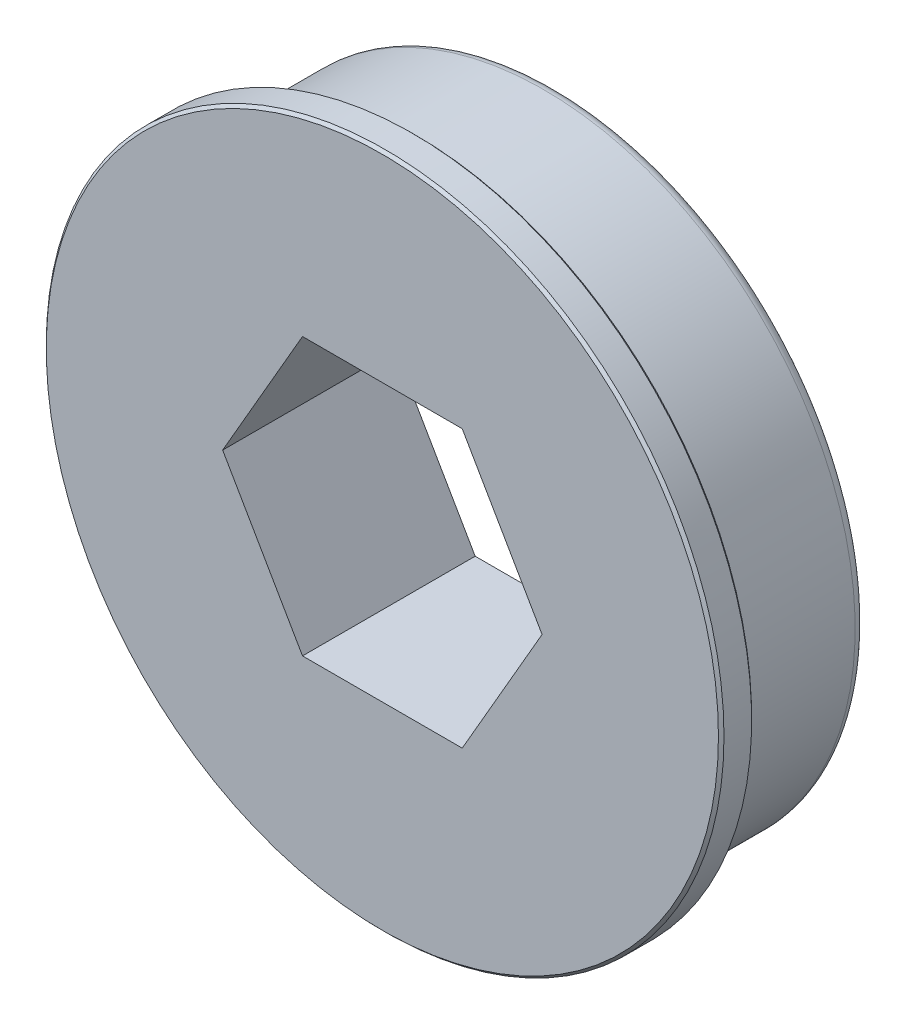
ISO-10303-21;
HEADER;
FILE_DESCRIPTION(('STEP AP214'),'2;1');
FILE_NAME('part.step','',(''),(''),'','','');
FILE_SCHEMA(('AUTOMOTIVE_DESIGN { 1 0 10303 214 1 1 1 1 }'));
ENDSEC;
DATA;
#1=APPLICATION_CONTEXT('core data for automotive mechanical design processes');
#2=APPLICATION_PROTOCOL_DEFINITION('international standard','automotive_design',2000,#1);
#3=PRODUCT_CONTEXT('',#1,'mechanical');
#4=PRODUCT('Part','Part','',(#3));
#5=PRODUCT_RELATED_PRODUCT_CATEGORY('part','',(#4));
#6=PRODUCT_DEFINITION_FORMATION('','',#4);
#7=PRODUCT_DEFINITION_CONTEXT('part definition',#1,'design');
#8=PRODUCT_DEFINITION('design','',#6,#7);
#9=PRODUCT_DEFINITION_SHAPE('','',#8);
#10=(LENGTH_UNIT() NAMED_UNIT(*) SI_UNIT(.MILLI.,.METRE.));
#11=(NAMED_UNIT(*) PLANE_ANGLE_UNIT() SI_UNIT($,.RADIAN.));
#12=(NAMED_UNIT(*) SI_UNIT($,.STERADIAN.) SOLID_ANGLE_UNIT());
#13=UNCERTAINTY_MEASURE_WITH_UNIT(LENGTH_MEASURE(1.E-05),#10,'distance_accuracy_value','');
#14=(GEOMETRIC_REPRESENTATION_CONTEXT(3) GLOBAL_UNCERTAINTY_ASSIGNED_CONTEXT((#13)) GLOBAL_UNIT_ASSIGNED_CONTEXT((#10,
#11,#12)) REPRESENTATION_CONTEXT('',''));
#15=CARTESIAN_POINT('',(0.,0.,0.));
#16=DIRECTION('',(0.,0.,1.));
#17=DIRECTION('',(1.,0.,0.));
#18=AXIS2_PLACEMENT_3D('',#15,#16,#17);
#19=CARTESIAN_POINT('',(0.,0.,7.92734));
#20=DIRECTION('',(0.,0.,-1.));
#21=DIRECTION('',(-1.,0.,0.));
#22=AXIS2_PLACEMENT_3D('',#19,#20,#21);
#23=CYLINDRICAL_SURFACE('',#22,15.5575);
#24=CARTESIAN_POINT('',(0.,0.,6.53034000000032));
#25=DIRECTION('',(0.,0.,-1.));
#26=DIRECTION('',(-1.,0.,0.));
#27=AXIS2_PLACEMENT_3D('',#24,#25,#26);
#28=CIRCLE('',#27,15.5575);
#29=CARTESIAN_POINT('',(-15.5575,0.,6.53034000000032));
#30=VERTEX_POINT('',#29);
#31=EDGE_CURVE('E152',#30,#30,#28,.F.);
#32=ORIENTED_EDGE('',*,*,#31,.T.);
#33=EDGE_LOOP('',(#32));
#34=FACE_BOUND('',#33,.T.);
#35=CARTESIAN_POINT('',(0.,0.,7.80034000000032));
#36=DIRECTION('',(0.,0.,1.));
#37=DIRECTION('',(1.,0.,0.));
#38=AXIS2_PLACEMENT_3D('',#35,#36,#37);
#39=CIRCLE('',#38,15.5575);
#40=CARTESIAN_POINT('',(15.5575,0.,7.80034000000032));
#41=VERTEX_POINT('',#40);
#42=EDGE_CURVE('E149',#41,#41,#39,.F.);
#43=ORIENTED_EDGE('',*,*,#42,.T.);
#44=EDGE_LOOP('',(#43));
#45=FACE_BOUND('',#44,.T.);
#46=ADVANCED_FACE('F33',(#34,#45),#23,.T.);
#47=CARTESIAN_POINT('',(15.5575,0.,7.92734));
#48=DIRECTION('',(0.,0.,1.));
#49=DIRECTION('',(1.,0.,0.));
#50=AXIS2_PLACEMENT_3D('',#47,#48,#49);
#51=PLANE('',#50);
#52=CARTESIAN_POINT('',(0.,0.,7.92734));
#53=DIRECTION('',(0.,0.,1.));
#54=DIRECTION('',(1.,0.,0.));
#55=AXIS2_PLACEMENT_3D('',#52,#53,#54);
#56=CIRCLE('',#55,15.4304999999997);
#57=CARTESIAN_POINT('',(15.4304999999997,0.,7.92734));
#58=VERTEX_POINT('',#57);
#59=EDGE_CURVE('E155',#58,#58,#56,.T.);
#60=ORIENTED_EDGE('',*,*,#59,.T.);
#61=EDGE_LOOP('',(#60));
#62=FACE_BOUND('',#61,.T.);
#63=DIRECTION('',(0.5,0.866025403784439,0.));
#64=VECTOR('',#63,1.);
#65=CARTESIAN_POINT('',(3.66617420935412,-6.35,7.92734));
#66=LINE('',#65,#64);
#67=CARTESIAN_POINT('',(3.66617420935412,-6.35,7.92734));
#68=VERTEX_POINT('',#67);
#69=CARTESIAN_POINT('',(7.33234841870824,0.,7.92734));
#70=VERTEX_POINT('',#69);
#71=EDGE_CURVE('E48',#68,#70,#66,.T.);
#72=ORIENTED_EDGE('',*,*,#71,.F.);
#73=DIRECTION('',(1.,0.,0.));
#74=VECTOR('',#73,1.);
#75=CARTESIAN_POINT('',(-3.66617420935413,-6.35,7.92734));
#76=LINE('',#75,#74);
#77=CARTESIAN_POINT('',(-3.66617420935413,-6.35,7.92734));
#78=VERTEX_POINT('',#77);
#79=EDGE_CURVE('E104',#78,#68,#76,.T.);
#80=ORIENTED_EDGE('',*,*,#79,.F.);
#81=DIRECTION('',(0.5,-0.866025403784439,0.));
#82=VECTOR('',#81,1.);
#83=CARTESIAN_POINT('',(-7.33234841870825,0.,7.92734));
#84=LINE('',#83,#82);
#85=CARTESIAN_POINT('',(-7.33234841870825,0.,7.92734));
#86=VERTEX_POINT('',#85);
#87=EDGE_CURVE('E107',#86,#78,#84,.T.);
#88=ORIENTED_EDGE('',*,*,#87,.F.);
#89=DIRECTION('',(-0.5,-0.866025403784439,0.));
#90=VECTOR('',#89,1.);
#91=CARTESIAN_POINT('',(-3.66617420935413,6.35,7.92734));
#92=LINE('',#91,#90);
#93=CARTESIAN_POINT('',(-3.66617420935413,6.35,7.92734));
#94=VERTEX_POINT('',#93);
#95=EDGE_CURVE('E123',#94,#86,#92,.T.);
#96=ORIENTED_EDGE('',*,*,#95,.F.);
#97=DIRECTION('',(-1.,0.,0.));
#98=VECTOR('',#97,1.);
#99=CARTESIAN_POINT('',(3.66617420935412,6.35,7.92734));
#100=LINE('',#99,#98);
#101=CARTESIAN_POINT('',(3.66617420935412,6.35,7.92734));
#102=VERTEX_POINT('',#101);
#103=EDGE_CURVE('E120',#102,#94,#100,.T.);
#104=ORIENTED_EDGE('',*,*,#103,.F.);
#105=DIRECTION('',(-0.5,0.866025403784438,0.));
#106=VECTOR('',#105,1.);
#107=CARTESIAN_POINT('',(7.33234841870825,0.,7.92734));
#108=LINE('',#107,#106);
#109=EDGE_CURVE('E118',#70,#102,#108,.T.);
#110=ORIENTED_EDGE('',*,*,#109,.F.);
#111=EDGE_LOOP('',(#72,#80,#88,#96,#104,#110));
#112=FACE_BOUND('',#111,.T.);
#113=ADVANCED_FACE('F171',(#62,#112),#51,.T.);
#114=CARTESIAN_POINT('',(0.,0.,0.));
#115=DIRECTION('',(0.,0.,-1.));
#116=DIRECTION('',(-1.,0.,0.));
#117=AXIS2_PLACEMENT_3D('',#114,#115,#116);
#118=PLANE('',#117);
#119=CARTESIAN_POINT('',(0.,0.,0.));
#120=DIRECTION('',(0.,0.,-1.));
#121=DIRECTION('',(-1.,0.,0.));
#122=AXIS2_PLACEMENT_3D('',#119,#120,#121);
#123=CIRCLE('',#122,13.7795);
#124=CARTESIAN_POINT('',(-13.7795,0.,0.));
#125=VERTEX_POINT('',#124);
#126=EDGE_CURVE('E41',#125,#125,#123,.T.);
#127=ORIENTED_EDGE('',*,*,#126,.T.);
#128=EDGE_LOOP('',(#127));
#129=FACE_BOUND('',#128,.T.);
#130=DIRECTION('',(0.5,0.866025403784439,0.));
#131=VECTOR('',#130,1.);
#132=CARTESIAN_POINT('',(3.66617420935412,-6.35,0.));
#133=LINE('',#132,#131);
#134=CARTESIAN_POINT('',(3.66617420935412,-6.35,0.));
#135=VERTEX_POINT('',#134);
#136=CARTESIAN_POINT('',(7.33234841870825,0.,0.));
#137=VERTEX_POINT('',#136);
#138=EDGE_CURVE('E88',#135,#137,#133,.T.);
#139=ORIENTED_EDGE('',*,*,#138,.T.);
#140=DIRECTION('',(-0.5,0.866025403784438,0.));
#141=VECTOR('',#140,1.);
#142=CARTESIAN_POINT('',(7.33234841870825,0.,0.));
#143=LINE('',#142,#141);
#144=CARTESIAN_POINT('',(3.66617420935412,6.35,0.));
#145=VERTEX_POINT('',#144);
#146=EDGE_CURVE('E97',#137,#145,#143,.T.);
#147=ORIENTED_EDGE('',*,*,#146,.T.);
#148=DIRECTION('',(-1.,0.,0.));
#149=VECTOR('',#148,1.);
#150=CARTESIAN_POINT('',(3.66617420935412,6.35,0.));
#151=LINE('',#150,#149);
#152=CARTESIAN_POINT('',(-3.66617420935413,6.35,0.));
#153=VERTEX_POINT('',#152);
#154=EDGE_CURVE('E56',#145,#153,#151,.T.);
#155=ORIENTED_EDGE('',*,*,#154,.T.);
#156=DIRECTION('',(-0.5,-0.866025403784439,0.));
#157=VECTOR('',#156,1.);
#158=CARTESIAN_POINT('',(-3.66617420935413,6.35,0.));
#159=LINE('',#158,#157);
#160=CARTESIAN_POINT('',(-7.33234841870825,0.,0.));
#161=VERTEX_POINT('',#160);
#162=EDGE_CURVE('E111',#153,#161,#159,.T.);
#163=ORIENTED_EDGE('',*,*,#162,.T.);
#164=DIRECTION('',(0.5,-0.866025403784439,0.));
#165=VECTOR('',#164,1.);
#166=CARTESIAN_POINT('',(-7.33234841870825,0.,0.));
#167=LINE('',#166,#165);
#168=CARTESIAN_POINT('',(-3.66617420935413,-6.35,0.));
#169=VERTEX_POINT('',#168);
#170=EDGE_CURVE('E114',#161,#169,#167,.T.);
#171=ORIENTED_EDGE('',*,*,#170,.T.);
#172=DIRECTION('',(1.,0.,0.));
#173=VECTOR('',#172,1.);
#174=CARTESIAN_POINT('',(-3.66617420935413,-6.35,0.));
#175=LINE('',#174,#173);
#176=EDGE_CURVE('E94',#169,#135,#175,.T.);
#177=ORIENTED_EDGE('',*,*,#176,.T.);
#178=EDGE_LOOP('',(#139,#147,#155,#163,#171,#177));
#179=FACE_BOUND('',#178,.T.);
#180=ADVANCED_FACE('F101',(#129,#179),#118,.T.);
#181=CARTESIAN_POINT('',(0.,0.,7.92734));
#182=DIRECTION('',(0.,0.,-1.));
#183=DIRECTION('',(-1.,0.,0.));
#184=AXIS2_PLACEMENT_3D('',#181,#182,#183);
#185=CYLINDRICAL_SURFACE('',#184,14.2875);
#186=CARTESIAN_POINT('',(0.,0.,0.508000000000003));
#187=DIRECTION('',(0.,0.,-1.));
#188=DIRECTION('',(-1.,0.,0.));
#189=AXIS2_PLACEMENT_3D('',#186,#187,#188);
#190=CIRCLE('',#189,14.2875);
#191=CARTESIAN_POINT('',(-14.2875,0.,0.508000000000003));
#192=VERTEX_POINT('',#191);
#193=EDGE_CURVE('E11',#192,#192,#190,.F.);
#194=ORIENTED_EDGE('',*,*,#193,.T.);
#195=EDGE_LOOP('',(#194));
#196=FACE_BOUND('',#195,.T.);
#197=CARTESIAN_POINT('',(0.,0.,5.89534));
#198=DIRECTION('',(0.,0.,-1.));
#199=DIRECTION('',(-1.,0.,0.));
#200=AXIS2_PLACEMENT_3D('',#197,#198,#199);
#201=CIRCLE('',#200,14.2875);
#202=CARTESIAN_POINT('',(-14.2875,0.,5.89534));
#203=VERTEX_POINT('',#202);
#204=EDGE_CURVE('E143',#203,#203,#201,.T.);
#205=ORIENTED_EDGE('',*,*,#204,.T.);
#206=EDGE_LOOP('',(#205));
#207=FACE_BOUND('',#206,.T.);
#208=ADVANCED_FACE('F208',(#196,#207),#185,.T.);
#209=CARTESIAN_POINT('',(14.2875,0.,5.89534));
#210=DIRECTION('',(0.,0.,1.));
#211=DIRECTION('',(1.,0.,0.));
#212=AXIS2_PLACEMENT_3D('',#209,#210,#211);
#213=PLANE('',#212);
#214=CARTESIAN_POINT('',(0.,0.,5.89534));
#215=DIRECTION('',(0.,0.,-1.));
#216=DIRECTION('',(-1.,0.,0.));
#217=AXIS2_PLACEMENT_3D('',#214,#215,#216);
#218=CIRCLE('',#217,13.97);
#219=CARTESIAN_POINT('',(-13.97,0.,5.89534));
#220=VERTEX_POINT('',#219);
#221=EDGE_CURVE('E140',#220,#220,#218,.T.);
#222=ORIENTED_EDGE('',*,*,#221,.T.);
#223=EDGE_LOOP('',(#222));
#224=FACE_BOUND('',#223,.T.);
#225=ORIENTED_EDGE('',*,*,#204,.F.);
#226=EDGE_LOOP('',(#225));
#227=FACE_BOUND('',#226,.T.);
#228=ADVANCED_FACE('F202',(#224,#227),#213,.T.);
#229=CARTESIAN_POINT('',(0.,0.,7.92734));
#230=DIRECTION('',(0.,0.,-1.));
#231=DIRECTION('',(-1.,0.,0.));
#232=AXIS2_PLACEMENT_3D('',#229,#230,#231);
#233=CYLINDRICAL_SURFACE('',#232,13.97);
#234=CARTESIAN_POINT('',(0.,0.,6.40333999999999));
#235=DIRECTION('',(0.,0.,-1.));
#236=DIRECTION('',(-1.,0.,0.));
#237=AXIS2_PLACEMENT_3D('',#234,#235,#236);
#238=CIRCLE('',#237,13.97);
#239=CARTESIAN_POINT('',(-13.97,0.,6.40333999999999));
#240=VERTEX_POINT('',#239);
#241=EDGE_CURVE('E130',#240,#240,#238,.T.);
#242=ORIENTED_EDGE('',*,*,#241,.T.);
#243=EDGE_LOOP('',(#242));
#244=FACE_BOUND('',#243,.T.);
#245=ORIENTED_EDGE('',*,*,#221,.F.);
#246=EDGE_LOOP('',(#245));
#247=FACE_BOUND('',#246,.T.);
#248=ADVANCED_FACE('F196',(#244,#247),#233,.T.);
#249=CARTESIAN_POINT('',(13.97,0.,6.40334));
#250=DIRECTION('',(0.,0.,-1.));
#251=DIRECTION('',(-1.,0.,0.));
#252=AXIS2_PLACEMENT_3D('',#249,#250,#251);
#253=PLANE('',#252);
#254=CARTESIAN_POINT('',(0.,0.,6.40334));
#255=DIRECTION('',(0.,0.,-1.));
#256=DIRECTION('',(-1.,0.,0.));
#257=AXIS2_PLACEMENT_3D('',#254,#255,#256);
#258=CIRCLE('',#257,15.4305000000003);
#259=CARTESIAN_POINT('',(-15.4305000000003,0.,6.40334));
#260=VERTEX_POINT('',#259);
#261=EDGE_CURVE('E146',#260,#260,#258,.T.);
#262=ORIENTED_EDGE('',*,*,#261,.T.);
#263=EDGE_LOOP('',(#262));
#264=FACE_BOUND('',#263,.T.);
#265=ORIENTED_EDGE('',*,*,#241,.F.);
#266=EDGE_LOOP('',(#265));
#267=FACE_BOUND('',#266,.T.);
#268=ADVANCED_FACE('F193',(#264,#267),#253,.T.);
#269=CARTESIAN_POINT('',(3.66617420935412,-6.35,0.));
#270=DIRECTION('',(0.866025403784439,-0.499999999999999,0.));
#271=DIRECTION('',(0.5,0.866025403784439,0.));
#272=AXIS2_PLACEMENT_3D('',#269,#270,#271);
#273=PLANE('',#272);
#274=ORIENTED_EDGE('',*,*,#71,.T.);
#275=DIRECTION('',(0.,0.,1.));
#276=VECTOR('',#275,1.);
#277=CARTESIAN_POINT('',(7.33234841870825,0.,0.));
#278=LINE('',#277,#276);
#279=EDGE_CURVE('E84',#137,#70,#278,.T.);
#280=ORIENTED_EDGE('',*,*,#279,.F.);
#281=ORIENTED_EDGE('',*,*,#138,.F.);
#282=DIRECTION('',(0.,0.,1.));
#283=VECTOR('',#282,1.);
#284=CARTESIAN_POINT('',(3.66617420935412,-6.35,0.));
#285=LINE('',#284,#283);
#286=EDGE_CURVE('E128',#135,#68,#285,.T.);
#287=ORIENTED_EDGE('',*,*,#286,.T.);
#288=EDGE_LOOP('',(#274,#280,#281,#287));
#289=FACE_BOUND('',#288,.T.);
#290=ADVANCED_FACE('F86',(#289),#273,.F.);
#291=CARTESIAN_POINT('',(-3.66617420935413,-6.35,0.));
#292=DIRECTION('',(0.,-1.,0.));
#293=DIRECTION('',(0.,0.,-1.));
#294=AXIS2_PLACEMENT_3D('',#291,#292,#293);
#295=PLANE('',#294);
#296=ORIENTED_EDGE('',*,*,#79,.T.);
#297=ORIENTED_EDGE('',*,*,#286,.F.);
#298=ORIENTED_EDGE('',*,*,#176,.F.);
#299=DIRECTION('',(0.,0.,1.));
#300=VECTOR('',#299,1.);
#301=CARTESIAN_POINT('',(-3.66617420935413,-6.35,0.));
#302=LINE('',#301,#300);
#303=EDGE_CURVE('E131',#169,#78,#302,.T.);
#304=ORIENTED_EDGE('',*,*,#303,.T.);
#305=EDGE_LOOP('',(#296,#297,#298,#304));
#306=FACE_BOUND('',#305,.T.);
#307=ADVANCED_FACE('F220',(#306),#295,.F.);
#308=CARTESIAN_POINT('',(-7.33234841870825,0.,0.));
#309=DIRECTION('',(-0.866025403784439,-0.5,0.));
#310=DIRECTION('',(0.5,-0.866025403784439,0.));
#311=AXIS2_PLACEMENT_3D('',#308,#309,#310);
#312=PLANE('',#311);
#313=ORIENTED_EDGE('',*,*,#87,.T.);
#314=ORIENTED_EDGE('',*,*,#303,.F.);
#315=ORIENTED_EDGE('',*,*,#170,.F.);
#316=DIRECTION('',(0.,0.,1.));
#317=VECTOR('',#316,1.);
#318=CARTESIAN_POINT('',(-7.33234841870825,0.,0.));
#319=LINE('',#318,#317);
#320=EDGE_CURVE('E133',#161,#86,#319,.T.);
#321=ORIENTED_EDGE('',*,*,#320,.T.);
#322=EDGE_LOOP('',(#313,#314,#315,#321));
#323=FACE_BOUND('',#322,.T.);
#324=ADVANCED_FACE('F227',(#323),#312,.F.);
#325=CARTESIAN_POINT('',(-3.66617420935413,6.35,0.));
#326=DIRECTION('',(-0.866025403784439,0.5,0.));
#327=DIRECTION('',(-0.5,-0.866025403784439,0.));
#328=AXIS2_PLACEMENT_3D('',#325,#326,#327);
#329=PLANE('',#328);
#330=ORIENTED_EDGE('',*,*,#95,.T.);
#331=ORIENTED_EDGE('',*,*,#320,.F.);
#332=ORIENTED_EDGE('',*,*,#162,.F.);
#333=DIRECTION('',(0.,0.,1.));
#334=VECTOR('',#333,1.);
#335=CARTESIAN_POINT('',(-3.66617420935413,6.35,0.));
#336=LINE('',#335,#334);
#337=EDGE_CURVE('E135',#153,#94,#336,.T.);
#338=ORIENTED_EDGE('',*,*,#337,.T.);
#339=EDGE_LOOP('',(#330,#331,#332,#338));
#340=FACE_BOUND('',#339,.T.);
#341=ADVANCED_FACE('F224',(#340),#329,.F.);
#342=CARTESIAN_POINT('',(3.66617420935412,6.35,0.));
#343=DIRECTION('',(0.,1.,0.));
#344=DIRECTION('',(0.,0.,1.));
#345=AXIS2_PLACEMENT_3D('',#342,#343,#344);
#346=PLANE('',#345);
#347=ORIENTED_EDGE('',*,*,#103,.T.);
#348=ORIENTED_EDGE('',*,*,#337,.F.);
#349=ORIENTED_EDGE('',*,*,#154,.F.);
#350=DIRECTION('',(0.,0.,1.));
#351=VECTOR('',#350,1.);
#352=CARTESIAN_POINT('',(3.66617420935412,6.35,0.));
#353=LINE('',#352,#351);
#354=EDGE_CURVE('E93',#145,#102,#353,.T.);
#355=ORIENTED_EDGE('',*,*,#354,.T.);
#356=EDGE_LOOP('',(#347,#348,#349,#355));
#357=FACE_BOUND('',#356,.T.);
#358=ADVANCED_FACE('F187',(#357),#346,.F.);
#359=CARTESIAN_POINT('',(7.33234841870825,0.,0.));
#360=DIRECTION('',(0.866025403784439,0.5,0.));
#361=DIRECTION('',(-0.5,0.866025403784439,0.));
#362=AXIS2_PLACEMENT_3D('',#359,#360,#361);
#363=PLANE('',#362);
#364=ORIENTED_EDGE('',*,*,#109,.T.);
#365=ORIENTED_EDGE('',*,*,#354,.F.);
#366=ORIENTED_EDGE('',*,*,#146,.F.);
#367=ORIENTED_EDGE('',*,*,#279,.T.);
#368=EDGE_LOOP('',(#364,#365,#366,#367));
#369=FACE_BOUND('',#368,.T.);
#370=ADVANCED_FACE('F98',(#369),#363,.F.);
#371=CARTESIAN_POINT('',(0.,0.,6.40334));
#372=DIRECTION('',(0.,0.,1.));
#373=DIRECTION('',(1.,0.,0.));
#374=AXIS2_PLACEMENT_3D('',#371,#372,#373);
#375=CONICAL_SURFACE('',#374,15.4305000000003,0.785398163394901);
#376=ORIENTED_EDGE('',*,*,#31,.F.);
#377=EDGE_LOOP('',(#376));
#378=FACE_BOUND('',#377,.T.);
#379=ORIENTED_EDGE('',*,*,#261,.F.);
#380=EDGE_LOOP('',(#379));
#381=FACE_BOUND('',#380,.T.);
#382=ADVANCED_FACE('F167',(#378,#381),#375,.T.);
#383=CARTESIAN_POINT('',(0.,0.,7.80034000000032));
#384=DIRECTION('',(0.,0.,-1.));
#385=DIRECTION('',(-1.,0.,0.));
#386=AXIS2_PLACEMENT_3D('',#383,#384,#385);
#387=CONICAL_SURFACE('',#386,15.5575,0.785398163400003);
#388=ORIENTED_EDGE('',*,*,#59,.F.);
#389=EDGE_LOOP('',(#388));
#390=FACE_BOUND('',#389,.T.);
#391=ORIENTED_EDGE('',*,*,#42,.F.);
#392=EDGE_LOOP('',(#391));
#393=FACE_BOUND('',#392,.T.);
#394=ADVANCED_FACE('F162',(#390,#393),#387,.T.);
#395=CARTESIAN_POINT('',(0.,0.,0.508000000000003));
#396=DIRECTION('',(0.,0.,-1.));
#397=DIRECTION('',(-1.,0.,0.));
#398=AXIS2_PLACEMENT_3D('',#395,#396,#397);
#399=TOROIDAL_SURFACE('',#398,13.7795,0.508000000000003);
#400=ORIENTED_EDGE('',*,*,#193,.F.);
#401=EDGE_LOOP('',(#400));
#402=FACE_BOUND('',#401,.T.);
#403=ORIENTED_EDGE('',*,*,#126,.F.);
#404=EDGE_LOOP('',(#403));
#405=FACE_BOUND('',#404,.T.);
#406=ADVANCED_FACE('F35',(#402,#405),#399,.T.);
#407=CLOSED_SHELL('',(#46,#113,#180,#208,#228,#248,#268,#290,#307,#324,#341,#358,#370,#382,#394,#406));
#408=MANIFOLD_SOLID_BREP('B2',#407);
#409=ADVANCED_BREP_SHAPE_REPRESENTATION('',(#18,#408),#14);
#410=SHAPE_DEFINITION_REPRESENTATION(#9,#409);
ENDSEC;
END-ISO-10303-21;
